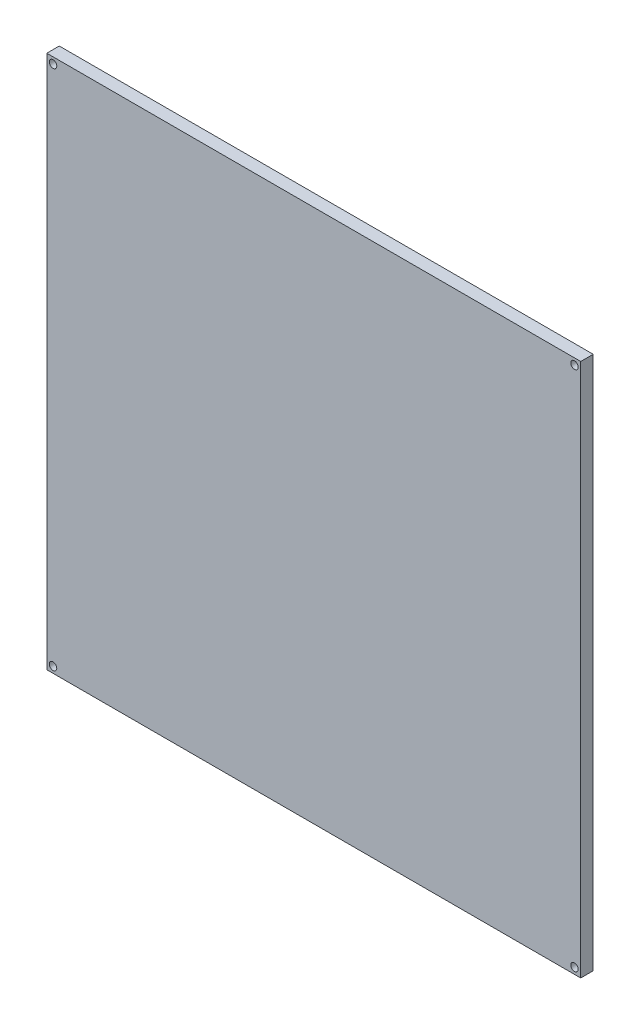
ISO-10303-21;
HEADER;
FILE_DESCRIPTION(('STEP AP214'),'2;1');
FILE_NAME('part.step','',(''),(''),'','','');
FILE_SCHEMA(('AUTOMOTIVE_DESIGN { 1 0 10303 214 1 1 1 1 }'));
ENDSEC;
DATA;
#1=APPLICATION_CONTEXT('core data for automotive mechanical design processes');
#2=APPLICATION_PROTOCOL_DEFINITION('international standard','automotive_design',2000,#1);
#3=PRODUCT_CONTEXT('',#1,'mechanical');
#4=PRODUCT('Part','Part','',(#3));
#5=PRODUCT_RELATED_PRODUCT_CATEGORY('part','',(#4));
#6=PRODUCT_DEFINITION_FORMATION('','',#4);
#7=PRODUCT_DEFINITION_CONTEXT('part definition',#1,'design');
#8=PRODUCT_DEFINITION('design','',#6,#7);
#9=PRODUCT_DEFINITION_SHAPE('','',#8);
#10=(LENGTH_UNIT() NAMED_UNIT(*) SI_UNIT(.MILLI.,.METRE.));
#11=(NAMED_UNIT(*) PLANE_ANGLE_UNIT() SI_UNIT($,.RADIAN.));
#12=(NAMED_UNIT(*) SI_UNIT($,.STERADIAN.) SOLID_ANGLE_UNIT());
#13=UNCERTAINTY_MEASURE_WITH_UNIT(LENGTH_MEASURE(1.E-05),#10,'distance_accuracy_value','');
#14=(GEOMETRIC_REPRESENTATION_CONTEXT(3) GLOBAL_UNCERTAINTY_ASSIGNED_CONTEXT((#13)) GLOBAL_UNIT_ASSIGNED_CONTEXT((#10,
#11,#12)) REPRESENTATION_CONTEXT('',''));
#15=CARTESIAN_POINT('',(0.,0.,0.));
#16=DIRECTION('',(0.,0.,1.));
#17=DIRECTION('',(1.,0.,0.));
#18=AXIS2_PLACEMENT_3D('',#15,#16,#17);
#19=CARTESIAN_POINT('',(0.,0.,-5.));
#20=DIRECTION('',(-1.,0.,0.));
#21=DIRECTION('',(0.,0.,1.));
#22=AXIS2_PLACEMENT_3D('',#19,#20,#21);
#23=PLANE('',#22);
#24=DIRECTION('',(0.,-1.,0.));
#25=VECTOR('',#24,1.);
#26=CARTESIAN_POINT('',(0.,0.,0.));
#27=LINE('',#26,#25);
#28=CARTESIAN_POINT('',(0.,214.,0.));
#29=VERTEX_POINT('',#28);
#30=CARTESIAN_POINT('',(0.,0.,0.));
#31=VERTEX_POINT('',#30);
#32=EDGE_CURVE('E113',#29,#31,#27,.T.);
#33=ORIENTED_EDGE('',*,*,#32,.F.);
#34=DIRECTION('',(0.,0.,1.));
#35=VECTOR('',#34,1.);
#36=CARTESIAN_POINT('',(0.,214.,-5.));
#37=LINE('',#36,#35);
#38=CARTESIAN_POINT('',(0.,214.,-5.));
#39=VERTEX_POINT('',#38);
#40=EDGE_CURVE('E12',#39,#29,#37,.T.);
#41=ORIENTED_EDGE('',*,*,#40,.F.);
#42=DIRECTION('',(0.,-1.,0.));
#43=VECTOR('',#42,1.);
#44=CARTESIAN_POINT('',(0.,0.,-5.));
#45=LINE('',#44,#43);
#46=CARTESIAN_POINT('',(0.,0.,-5.));
#47=VERTEX_POINT('',#46);
#48=EDGE_CURVE('E105',#39,#47,#45,.T.);
#49=ORIENTED_EDGE('',*,*,#48,.T.);
#50=DIRECTION('',(0.,0.,1.));
#51=VECTOR('',#50,1.);
#52=CARTESIAN_POINT('',(0.,0.,-5.));
#53=LINE('',#52,#51);
#54=EDGE_CURVE('E42',#47,#31,#53,.T.);
#55=ORIENTED_EDGE('',*,*,#54,.T.);
#56=EDGE_LOOP('',(#33,#41,#49,#55));
#57=FACE_BOUND('',#56,.T.);
#58=ADVANCED_FACE('F39',(#57),#23,.T.);
#59=CARTESIAN_POINT('',(0.,214.,-5.));
#60=DIRECTION('',(0.,1.,0.));
#61=DIRECTION('',(0.,0.,1.));
#62=AXIS2_PLACEMENT_3D('',#59,#60,#61);
#63=PLANE('',#62);
#64=DIRECTION('',(-1.,0.,0.));
#65=VECTOR('',#64,1.);
#66=CARTESIAN_POINT('',(0.,214.,0.));
#67=LINE('',#66,#65);
#68=CARTESIAN_POINT('',(214.,214.,0.));
#69=VERTEX_POINT('',#68);
#70=EDGE_CURVE('E108',#69,#29,#67,.T.);
#71=ORIENTED_EDGE('',*,*,#70,.F.);
#72=DIRECTION('',(0.,0.,1.));
#73=VECTOR('',#72,1.);
#74=CARTESIAN_POINT('',(214.,214.,-5.));
#75=LINE('',#74,#73);
#76=CARTESIAN_POINT('',(214.,214.,-5.));
#77=VERTEX_POINT('',#76);
#78=EDGE_CURVE('E49',#77,#69,#75,.T.);
#79=ORIENTED_EDGE('',*,*,#78,.F.);
#80=DIRECTION('',(-1.,0.,0.));
#81=VECTOR('',#80,1.);
#82=CARTESIAN_POINT('',(0.,214.,-5.));
#83=LINE('',#82,#81);
#84=EDGE_CURVE('E100',#77,#39,#83,.T.);
#85=ORIENTED_EDGE('',*,*,#84,.T.);
#86=ORIENTED_EDGE('',*,*,#40,.T.);
#87=EDGE_LOOP('',(#71,#79,#85,#86));
#88=FACE_BOUND('',#87,.T.);
#89=ADVANCED_FACE('F135',(#88),#63,.T.);
#90=CARTESIAN_POINT('',(214.,0.,-5.));
#91=DIRECTION('',(1.,0.,0.));
#92=DIRECTION('',(0.,0.,-1.));
#93=AXIS2_PLACEMENT_3D('',#90,#91,#92);
#94=PLANE('',#93);
#95=DIRECTION('',(0.,1.,0.));
#96=VECTOR('',#95,1.);
#97=CARTESIAN_POINT('',(214.,0.,0.));
#98=LINE('',#97,#96);
#99=CARTESIAN_POINT('',(214.,0.,0.));
#100=VERTEX_POINT('',#99);
#101=EDGE_CURVE('E94',#100,#69,#98,.T.);
#102=ORIENTED_EDGE('',*,*,#101,.F.);
#103=DIRECTION('',(0.,0.,1.));
#104=VECTOR('',#103,1.);
#105=CARTESIAN_POINT('',(214.,0.,-5.));
#106=LINE('',#105,#104);
#107=CARTESIAN_POINT('',(214.,0.,-5.));
#108=VERTEX_POINT('',#107);
#109=EDGE_CURVE('E89',#108,#100,#106,.T.);
#110=ORIENTED_EDGE('',*,*,#109,.F.);
#111=DIRECTION('',(0.,1.,0.));
#112=VECTOR('',#111,1.);
#113=CARTESIAN_POINT('',(214.,0.,-5.));
#114=LINE('',#113,#112);
#115=EDGE_CURVE('E92',#108,#77,#114,.T.);
#116=ORIENTED_EDGE('',*,*,#115,.T.);
#117=ORIENTED_EDGE('',*,*,#78,.T.);
#118=EDGE_LOOP('',(#102,#110,#116,#117));
#119=FACE_BOUND('',#118,.T.);
#120=ADVANCED_FACE('F91',(#119),#94,.T.);
#121=CARTESIAN_POINT('',(0.,0.,-5.));
#122=DIRECTION('',(0.,-1.,0.));
#123=DIRECTION('',(0.,0.,-1.));
#124=AXIS2_PLACEMENT_3D('',#121,#122,#123);
#125=PLANE('',#124);
#126=DIRECTION('',(1.,0.,0.));
#127=VECTOR('',#126,1.);
#128=CARTESIAN_POINT('',(0.,0.,0.));
#129=LINE('',#128,#127);
#130=EDGE_CURVE('E118',#31,#100,#129,.T.);
#131=ORIENTED_EDGE('',*,*,#130,.F.);
#132=ORIENTED_EDGE('',*,*,#54,.F.);
#133=DIRECTION('',(1.,0.,0.));
#134=VECTOR('',#133,1.);
#135=CARTESIAN_POINT('',(0.,0.,-5.));
#136=LINE('',#135,#134);
#137=EDGE_CURVE('E99',#47,#108,#136,.T.);
#138=ORIENTED_EDGE('',*,*,#137,.T.);
#139=ORIENTED_EDGE('',*,*,#109,.T.);
#140=EDGE_LOOP('',(#131,#132,#138,#139));
#141=FACE_BOUND('',#140,.T.);
#142=ADVANCED_FACE('F103',(#141),#125,.T.);
#143=CARTESIAN_POINT('',(0.,0.,-5.));
#144=DIRECTION('',(0.,0.,-1.));
#145=DIRECTION('',(-1.,0.,0.));
#146=AXIS2_PLACEMENT_3D('',#143,#144,#145);
#147=PLANE('',#146);
#148=CARTESIAN_POINT('',(211.5,2.5,-5.));
#149=DIRECTION('',(0.,0.,1.));
#150=DIRECTION('',(1.,0.,0.));
#151=AXIS2_PLACEMENT_3D('',#148,#149,#150);
#152=CIRCLE('',#151,1.5);
#153=CARTESIAN_POINT('',(213.,2.5,-5.));
#154=VERTEX_POINT('',#153);
#155=EDGE_CURVE('E176',#154,#154,#152,.T.);
#156=ORIENTED_EDGE('',*,*,#155,.T.);
#157=EDGE_LOOP('',(#156));
#158=FACE_BOUND('',#157,.T.);
#159=CARTESIAN_POINT('',(2.5,2.5,-5.));
#160=DIRECTION('',(0.,0.,1.));
#161=DIRECTION('',(-1.,0.,0.));
#162=AXIS2_PLACEMENT_3D('',#159,#160,#161);
#163=CIRCLE('',#162,1.5);
#164=CARTESIAN_POINT('',(1.,2.5,-5.));
#165=VERTEX_POINT('',#164);
#166=EDGE_CURVE('E186',#165,#165,#163,.T.);
#167=ORIENTED_EDGE('',*,*,#166,.T.);
#168=EDGE_LOOP('',(#167));
#169=FACE_BOUND('',#168,.T.);
#170=CARTESIAN_POINT('',(211.5,211.5,-5.));
#171=DIRECTION('',(0.,0.,1.));
#172=DIRECTION('',(-1.,0.,0.));
#173=AXIS2_PLACEMENT_3D('',#170,#171,#172);
#174=CIRCLE('',#173,1.5);
#175=CARTESIAN_POINT('',(210.,211.5,-5.));
#176=VERTEX_POINT('',#175);
#177=EDGE_CURVE('E194',#176,#176,#174,.T.);
#178=ORIENTED_EDGE('',*,*,#177,.T.);
#179=EDGE_LOOP('',(#178));
#180=FACE_BOUND('',#179,.T.);
#181=CARTESIAN_POINT('',(2.5,211.5,-5.));
#182=DIRECTION('',(0.,0.,1.));
#183=DIRECTION('',(1.,0.,0.));
#184=AXIS2_PLACEMENT_3D('',#181,#182,#183);
#185=CIRCLE('',#184,1.5);
#186=CARTESIAN_POINT('',(4.,211.5,-5.));
#187=VERTEX_POINT('',#186);
#188=EDGE_CURVE('E119',#187,#187,#185,.T.);
#189=ORIENTED_EDGE('',*,*,#188,.T.);
#190=EDGE_LOOP('',(#189));
#191=FACE_BOUND('',#190,.T.);
#192=ORIENTED_EDGE('',*,*,#48,.F.);
#193=ORIENTED_EDGE('',*,*,#84,.F.);
#194=ORIENTED_EDGE('',*,*,#115,.F.);
#195=ORIENTED_EDGE('',*,*,#137,.F.);
#196=EDGE_LOOP('',(#192,#193,#194,#195));
#197=FACE_BOUND('',#196,.T.);
#198=ADVANCED_FACE('F98',(#158,#169,#180,#191,#197),#147,.T.);
#199=CARTESIAN_POINT('',(0.,0.,0.));
#200=DIRECTION('',(0.,0.,-1.));
#201=DIRECTION('',(-1.,0.,0.));
#202=AXIS2_PLACEMENT_3D('',#199,#200,#201);
#203=PLANE('',#202);
#204=CARTESIAN_POINT('',(211.5,2.5,0.));
#205=DIRECTION('',(0.,0.,1.));
#206=DIRECTION('',(1.,0.,0.));
#207=AXIS2_PLACEMENT_3D('',#204,#205,#206);
#208=CIRCLE('',#207,1.5);
#209=CARTESIAN_POINT('',(213.,2.5,0.));
#210=VERTEX_POINT('',#209);
#211=EDGE_CURVE('E179',#210,#210,#208,.T.);
#212=ORIENTED_EDGE('',*,*,#211,.F.);
#213=EDGE_LOOP('',(#212));
#214=FACE_BOUND('',#213,.T.);
#215=CARTESIAN_POINT('',(2.5,2.5,0.));
#216=DIRECTION('',(0.,0.,1.));
#217=DIRECTION('',(-1.,0.,0.));
#218=AXIS2_PLACEMENT_3D('',#215,#216,#217);
#219=CIRCLE('',#218,1.5);
#220=CARTESIAN_POINT('',(1.,2.5,0.));
#221=VERTEX_POINT('',#220);
#222=EDGE_CURVE('E183',#221,#221,#219,.T.);
#223=ORIENTED_EDGE('',*,*,#222,.F.);
#224=EDGE_LOOP('',(#223));
#225=FACE_BOUND('',#224,.T.);
#226=CARTESIAN_POINT('',(211.5,211.5,0.));
#227=DIRECTION('',(0.,0.,1.));
#228=DIRECTION('',(-1.,0.,0.));
#229=AXIS2_PLACEMENT_3D('',#226,#227,#228);
#230=CIRCLE('',#229,1.5);
#231=CARTESIAN_POINT('',(210.,211.5,0.));
#232=VERTEX_POINT('',#231);
#233=EDGE_CURVE('E190',#232,#232,#230,.T.);
#234=ORIENTED_EDGE('',*,*,#233,.F.);
#235=EDGE_LOOP('',(#234));
#236=FACE_BOUND('',#235,.T.);
#237=CARTESIAN_POINT('',(2.5,211.5,0.));
#238=DIRECTION('',(0.,0.,1.));
#239=DIRECTION('',(1.,0.,0.));
#240=AXIS2_PLACEMENT_3D('',#237,#238,#239);
#241=CIRCLE('',#240,1.5);
#242=CARTESIAN_POINT('',(4.,211.5,0.));
#243=VERTEX_POINT('',#242);
#244=EDGE_CURVE('E198',#243,#243,#241,.T.);
#245=ORIENTED_EDGE('',*,*,#244,.F.);
#246=EDGE_LOOP('',(#245));
#247=FACE_BOUND('',#246,.T.);
#248=ORIENTED_EDGE('',*,*,#32,.T.);
#249=ORIENTED_EDGE('',*,*,#130,.T.);
#250=ORIENTED_EDGE('',*,*,#101,.T.);
#251=ORIENTED_EDGE('',*,*,#70,.T.);
#252=EDGE_LOOP('',(#248,#249,#250,#251));
#253=FACE_BOUND('',#252,.T.);
#254=ADVANCED_FACE('F134',(#214,#225,#236,#247,#253),#203,.F.);
#255=CARTESIAN_POINT('',(2.5,211.5,-5.));
#256=DIRECTION('',(0.,0.,1.));
#257=DIRECTION('',(1.,0.,0.));
#258=AXIS2_PLACEMENT_3D('',#255,#256,#257);
#259=CYLINDRICAL_SURFACE('',#258,1.5);
#260=ORIENTED_EDGE('',*,*,#188,.F.);
#261=EDGE_LOOP('',(#260));
#262=FACE_BOUND('',#261,.T.);
#263=ORIENTED_EDGE('',*,*,#244,.T.);
#264=EDGE_LOOP('',(#263));
#265=FACE_BOUND('',#264,.T.);
#266=ADVANCED_FACE('F153',(#262,#265),#259,.F.);
#267=CARTESIAN_POINT('',(211.5,211.5,-5.));
#268=DIRECTION('',(0.,0.,1.));
#269=DIRECTION('',(1.,0.,0.));
#270=AXIS2_PLACEMENT_3D('',#267,#268,#269);
#271=CYLINDRICAL_SURFACE('',#270,1.5);
#272=ORIENTED_EDGE('',*,*,#177,.F.);
#273=EDGE_LOOP('',(#272));
#274=FACE_BOUND('',#273,.T.);
#275=ORIENTED_EDGE('',*,*,#233,.T.);
#276=EDGE_LOOP('',(#275));
#277=FACE_BOUND('',#276,.T.);
#278=ADVANCED_FACE('F160',(#274,#277),#271,.F.);
#279=CARTESIAN_POINT('',(2.5,2.5,-5.));
#280=DIRECTION('',(0.,0.,1.));
#281=DIRECTION('',(1.,0.,0.));
#282=AXIS2_PLACEMENT_3D('',#279,#280,#281);
#283=CYLINDRICAL_SURFACE('',#282,1.5);
#284=ORIENTED_EDGE('',*,*,#166,.F.);
#285=EDGE_LOOP('',(#284));
#286=FACE_BOUND('',#285,.T.);
#287=ORIENTED_EDGE('',*,*,#222,.T.);
#288=EDGE_LOOP('',(#287));
#289=FACE_BOUND('',#288,.T.);
#290=ADVANCED_FACE('F164',(#286,#289),#283,.F.);
#291=CARTESIAN_POINT('',(211.5,2.5,-5.));
#292=DIRECTION('',(0.,0.,1.));
#293=DIRECTION('',(1.,0.,0.));
#294=AXIS2_PLACEMENT_3D('',#291,#292,#293);
#295=CYLINDRICAL_SURFACE('',#294,1.5);
#296=ORIENTED_EDGE('',*,*,#155,.F.);
#297=EDGE_LOOP('',(#296));
#298=FACE_BOUND('',#297,.T.);
#299=ORIENTED_EDGE('',*,*,#211,.T.);
#300=EDGE_LOOP('',(#299));
#301=FACE_BOUND('',#300,.T.);
#302=ADVANCED_FACE('F168',(#298,#301),#295,.F.);
#303=CLOSED_SHELL('',(#58,#89,#120,#142,#198,#254,#266,#278,#290,#302));
#304=MANIFOLD_SOLID_BREP('B2',#303);
#305=ADVANCED_BREP_SHAPE_REPRESENTATION('',(#18,#304),#14);
#306=SHAPE_DEFINITION_REPRESENTATION(#9,#305);
ENDSEC;
END-ISO-10303-21;
